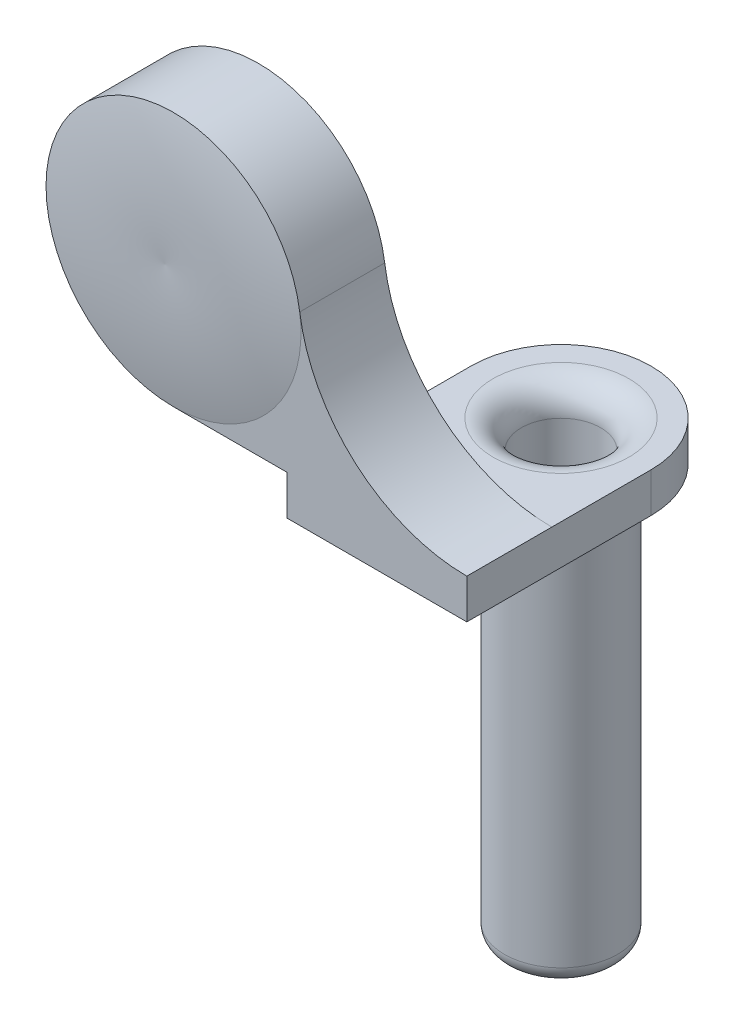
ISO-10303-21;
HEADER;
FILE_DESCRIPTION(('STEP AP214'),'2;1');
FILE_NAME('part.step','',(''),(''),'','','');
FILE_SCHEMA(('AUTOMOTIVE_DESIGN { 1 0 10303 214 1 1 1 1 }'));
ENDSEC;
DATA;
#1=APPLICATION_CONTEXT('core data for automotive mechanical design processes');
#2=APPLICATION_PROTOCOL_DEFINITION('international standard','automotive_design',2000,#1);
#3=PRODUCT_CONTEXT('',#1,'mechanical');
#4=PRODUCT('Part','Part','',(#3));
#5=PRODUCT_RELATED_PRODUCT_CATEGORY('part','',(#4));
#6=PRODUCT_DEFINITION_FORMATION('','',#4);
#7=PRODUCT_DEFINITION_CONTEXT('part definition',#1,'design');
#8=PRODUCT_DEFINITION('design','',#6,#7);
#9=PRODUCT_DEFINITION_SHAPE('','',#8);
#10=(LENGTH_UNIT() NAMED_UNIT(*) SI_UNIT(.MILLI.,.METRE.));
#11=(NAMED_UNIT(*) PLANE_ANGLE_UNIT() SI_UNIT($,.RADIAN.));
#12=(NAMED_UNIT(*) SI_UNIT($,.STERADIAN.) SOLID_ANGLE_UNIT());
#13=UNCERTAINTY_MEASURE_WITH_UNIT(LENGTH_MEASURE(1.E-05),#10,'distance_accuracy_value','');
#14=(GEOMETRIC_REPRESENTATION_CONTEXT(3) GLOBAL_UNCERTAINTY_ASSIGNED_CONTEXT((#13)) GLOBAL_UNIT_ASSIGNED_CONTEXT((#10,
#11,#12)) REPRESENTATION_CONTEXT('',''));
#15=CARTESIAN_POINT('',(0.,0.,0.));
#16=DIRECTION('',(0.,0.,1.));
#17=DIRECTION('',(1.,0.,0.));
#18=AXIS2_PLACEMENT_3D('',#15,#16,#17);
#19=CARTESIAN_POINT('',(3.175,16.,6.5));
#20=DIRECTION('',(0.,1.,0.));
#21=DIRECTION('',(-1.,0.,0.));
#22=AXIS2_PLACEMENT_3D('',#19,#20,#21);
#23=PLANE('',#22);
#24=DIRECTION('',(1.,0.,0.));
#25=VECTOR('',#24,1.);
#26=CARTESIAN_POINT('',(3.175,16.,3.5));
#27=LINE('',#26,#25);
#28=CARTESIAN_POINT('',(-7.18,16.,3.5));
#29=VERTEX_POINT('',#28);
#30=CARTESIAN_POINT('',(-3.175,16.,3.5));
#31=VERTEX_POINT('',#30);
#32=EDGE_CURVE('E186',#29,#31,#27,.T.);
#33=ORIENTED_EDGE('',*,*,#32,.T.);
#34=DIRECTION('',(0.,0.,1.));
#35=VECTOR('',#34,1.);
#36=CARTESIAN_POINT('',(-3.175,16.,-3.176));
#37=LINE('',#36,#35);
#38=CARTESIAN_POINT('',(-3.175,16.,6.5));
#39=VERTEX_POINT('',#38);
#40=EDGE_CURVE('E57',#31,#39,#37,.T.);
#41=ORIENTED_EDGE('',*,*,#40,.T.);
#42=DIRECTION('',(1.,0.,0.));
#43=VECTOR('',#42,1.);
#44=CARTESIAN_POINT('',(3.175,16.,6.5));
#45=LINE('',#44,#43);
#46=CARTESIAN_POINT('',(-7.18,16.,6.5));
#47=VERTEX_POINT('',#46);
#48=EDGE_CURVE('E118',#47,#39,#45,.T.);
#49=ORIENTED_EDGE('',*,*,#48,.F.);
#50=DIRECTION('',(0.,0.,-1.));
#51=VECTOR('',#50,1.);
#52=CARTESIAN_POINT('',(-7.18,16.,6.5));
#53=LINE('',#52,#51);
#54=EDGE_CURVE('E114',#47,#29,#53,.T.);
#55=ORIENTED_EDGE('',*,*,#54,.T.);
#56=EDGE_LOOP('',(#33,#41,#49,#55));
#57=FACE_BOUND('',#56,.T.);
#58=ADVANCED_FACE('F41',(#57),#23,.F.);
#59=CARTESIAN_POINT('',(-7.18,20.5,6.5));
#60=DIRECTION('',(0.,0.,-1.));
#61=DIRECTION('',(-1.,0.,0.));
#62=AXIS2_PLACEMENT_3D('',#59,#60,#61);
#63=CYLINDRICAL_SURFACE('',#62,4.5);
#64=CARTESIAN_POINT('',(-7.18,20.5,3.5));
#65=DIRECTION('',(0.,0.,1.));
#66=DIRECTION('',(1.,0.,0.));
#67=AXIS2_PLACEMENT_3D('',#64,#65,#66);
#68=CIRCLE('',#67,4.5);
#69=CARTESIAN_POINT('',(-2.72389463412405,21.1269967848495,3.5));
#70=VERTEX_POINT('',#69);
#71=EDGE_CURVE('E184',#70,#29,#68,.T.);
#72=ORIENTED_EDGE('',*,*,#71,.T.);
#73=ORIENTED_EDGE('',*,*,#54,.F.);
#74=CARTESIAN_POINT('',(-7.18,20.5,6.5));
#75=DIRECTION('',(0.,0.,1.));
#76=DIRECTION('',(1.,0.,0.));
#77=AXIS2_PLACEMENT_3D('',#74,#75,#76);
#78=CIRCLE('',#77,4.5);
#79=CARTESIAN_POINT('',(-2.72389463412406,21.1269967848495,6.5));
#80=VERTEX_POINT('',#79);
#81=EDGE_CURVE('E108',#80,#47,#78,.T.);
#82=ORIENTED_EDGE('',*,*,#81,.F.);
#83=DIRECTION('',(0.,0.,-1.));
#84=VECTOR('',#83,1.);
#85=CARTESIAN_POINT('',(-2.72389463412405,21.1269967848495,6.84703049766499));
#86=LINE('',#85,#84);
#87=EDGE_CURVE('E111',#80,#70,#86,.T.);
#88=ORIENTED_EDGE('',*,*,#87,.T.);
#89=EDGE_LOOP('',(#72,#73,#82,#88));
#90=FACE_BOUND('',#89,.T.);
#91=ADVANCED_FACE('F110',(#90),#63,.T.);
#92=CARTESIAN_POINT('',(-7.18,20.5,6.5));
#93=DIRECTION('',(0.,0.,1.));
#94=DIRECTION('',(1.,0.,0.));
#95=AXIS2_PLACEMENT_3D('',#92,#93,#94);
#96=PLANE('',#95);
#97=CARTESIAN_POINT('',(3.175,21.9570013888889,6.5));
#98=DIRECTION('',(0.,0.,1.));
#99=DIRECTION('',(1.,0.,0.));
#100=AXIS2_PLACEMENT_3D('',#97,#98,#99);
#101=CIRCLE('',#100,5.95700138888889);
#102=CARTESIAN_POINT('',(3.175,16.,6.5));
#103=VERTEX_POINT('',#102);
#104=EDGE_CURVE('E123',#103,#80,#101,.F.);
#105=ORIENTED_EDGE('',*,*,#104,.T.);
#106=CARTESIAN_POINT('',(-7.18,20.5,6.5));
#107=DIRECTION('',(0.,0.,-1.));
#108=DIRECTION('',(-1.,0.,0.));
#109=AXIS2_PLACEMENT_3D('',#106,#107,#108);
#110=CIRCLE('',#109,4.5);
#111=EDGE_CURVE('E132',#80,#47,#110,.T.);
#112=ORIENTED_EDGE('',*,*,#111,.T.);
#113=ORIENTED_EDGE('',*,*,#48,.T.);
#114=DIRECTION('',(0.,-1.,0.));
#115=VECTOR('',#114,1.);
#116=CARTESIAN_POINT('',(-3.175,16.,6.5));
#117=LINE('',#116,#115);
#118=CARTESIAN_POINT('',(-3.175,14.6,6.5));
#119=VERTEX_POINT('',#118);
#120=EDGE_CURVE('E159',#39,#119,#117,.T.);
#121=ORIENTED_EDGE('',*,*,#120,.T.);
#122=DIRECTION('',(1.,0.,0.));
#123=VECTOR('',#122,1.);
#124=CARTESIAN_POINT('',(-3.175,14.6,6.5));
#125=LINE('',#124,#123);
#126=CARTESIAN_POINT('',(3.175,14.6,6.5));
#127=VERTEX_POINT('',#126);
#128=EDGE_CURVE('E156',#119,#127,#125,.T.);
#129=ORIENTED_EDGE('',*,*,#128,.T.);
#130=DIRECTION('',(0.,1.,0.));
#131=VECTOR('',#130,1.);
#132=CARTESIAN_POINT('',(3.175,14.6,6.5));
#133=LINE('',#132,#131);
#134=EDGE_CURVE('E135',#127,#103,#133,.T.);
#135=ORIENTED_EDGE('',*,*,#134,.T.);
#136=EDGE_LOOP('',(#105,#112,#113,#121,#129,#135));
#137=FACE_BOUND('',#136,.T.);
#138=ADVANCED_FACE('F131',(#137),#96,.T.);
#139=CARTESIAN_POINT('',(-7.18,20.5,3.5));
#140=DIRECTION('',(0.,0.,1.));
#141=DIRECTION('',(1.,0.,0.));
#142=AXIS2_PLACEMENT_3D('',#139,#140,#141);
#143=PLANE('',#142);
#144=CARTESIAN_POINT('',(-7.18,20.5,3.5));
#145=DIRECTION('',(0.,0.,1.));
#146=DIRECTION('',(1.,0.,0.));
#147=AXIS2_PLACEMENT_3D('',#144,#145,#146);
#148=CIRCLE('',#147,3.45);
#149=CARTESIAN_POINT('',(-3.73,20.5,3.5));
#150=VERTEX_POINT('',#149);
#151=EDGE_CURVE('E11',#150,#150,#148,.T.);
#152=ORIENTED_EDGE('',*,*,#151,.T.);
#153=EDGE_LOOP('',(#152));
#154=FACE_BOUND('',#153,.T.);
#155=ORIENTED_EDGE('',*,*,#71,.F.);
#156=CARTESIAN_POINT('',(3.175,21.9570013888889,3.5));
#157=DIRECTION('',(0.,0.,-1.));
#158=DIRECTION('',(-1.,0.,0.));
#159=AXIS2_PLACEMENT_3D('',#156,#157,#158);
#160=CIRCLE('',#159,5.95700138888889);
#161=CARTESIAN_POINT('',(3.175,16.,3.5));
#162=VERTEX_POINT('',#161);
#163=EDGE_CURVE('E125',#162,#70,#160,.T.);
#164=ORIENTED_EDGE('',*,*,#163,.F.);
#165=EDGE_CURVE('E65',#31,#162,#27,.T.);
#166=ORIENTED_EDGE('',*,*,#165,.F.);
#167=ORIENTED_EDGE('',*,*,#32,.F.);
#168=EDGE_LOOP('',(#155,#164,#166,#167));
#169=FACE_BOUND('',#168,.T.);
#170=ADVANCED_FACE('F220',(#154,#169),#143,.F.);
#171=CARTESIAN_POINT('',(-7.18,20.5,6.275));
#172=DIRECTION('',(0.,0.,-1.));
#173=DIRECTION('',(-1.,0.,0.));
#174=AXIS2_PLACEMENT_3D('',#171,#172,#173);
#175=CYLINDRICAL_SURFACE('',#174,3.15);
#176=CARTESIAN_POINT('',(-7.18,20.5,3.8));
#177=DIRECTION('',(0.,0.,1.));
#178=DIRECTION('',(1.,0.,0.));
#179=AXIS2_PLACEMENT_3D('',#176,#177,#178);
#180=CIRCLE('',#179,3.15);
#181=CARTESIAN_POINT('',(-4.03,20.5,3.8));
#182=VERTEX_POINT('',#181);
#183=EDGE_CURVE('E50',#182,#182,#180,.F.);
#184=ORIENTED_EDGE('',*,*,#183,.T.);
#185=EDGE_LOOP('',(#184));
#186=FACE_BOUND('',#185,.T.);
#187=CARTESIAN_POINT('',(-7.18,20.5,6.275));
#188=DIRECTION('',(0.,0.,-1.));
#189=DIRECTION('',(-1.,0.,0.));
#190=AXIS2_PLACEMENT_3D('',#187,#188,#189);
#191=CIRCLE('',#190,3.15);
#192=CARTESIAN_POINT('',(-10.33,20.5,6.275));
#193=VERTEX_POINT('',#192);
#194=EDGE_CURVE('E167',#193,#193,#191,.T.);
#195=ORIENTED_EDGE('',*,*,#194,.F.);
#196=EDGE_LOOP('',(#195));
#197=FACE_BOUND('',#196,.T.);
#198=ADVANCED_FACE('F199',(#186,#197),#175,.F.);
#199=CARTESIAN_POINT('',(-7.18,20.5,6.275));
#200=DIRECTION('',(0.,0.,-1.));
#201=DIRECTION('',(-1.,0.,0.));
#202=AXIS2_PLACEMENT_3D('',#199,#200,#201);
#203=PLANE('',#202);
#204=ORIENTED_EDGE('',*,*,#194,.T.);
#205=EDGE_LOOP('',(#204));
#206=FACE_BOUND('',#205,.T.);
#207=ADVANCED_FACE('F228',(#206),#203,.T.);
#208=CARTESIAN_POINT('',(3.175,16.,-3.176));
#209=DIRECTION('',(0.,1.,0.));
#210=DIRECTION('',(0.,0.,1.));
#211=AXIS2_PLACEMENT_3D('',#208,#209,#210);
#212=PLANE('',#211);
#213=ORIENTED_EDGE('',*,*,#165,.T.);
#214=DIRECTION('',(0.,0.,1.));
#215=VECTOR('',#214,1.);
#216=CARTESIAN_POINT('',(3.175,16.,-3.176));
#217=LINE('',#216,#215);
#218=CARTESIAN_POINT('',(3.175,16.,0.));
#219=VERTEX_POINT('',#218);
#220=EDGE_CURVE('E146',#219,#162,#217,.T.);
#221=ORIENTED_EDGE('',*,*,#220,.F.);
#222=CARTESIAN_POINT('',(0.,16.,0.));
#223=DIRECTION('',(0.,1.,0.));
#224=DIRECTION('',(0.,0.,1.));
#225=AXIS2_PLACEMENT_3D('',#222,#223,#224);
#226=CIRCLE('',#225,3.175);
#227=CARTESIAN_POINT('',(-3.175,16.,0.));
#228=VERTEX_POINT('',#227);
#229=EDGE_CURVE('E272',#219,#228,#226,.T.);
#230=ORIENTED_EDGE('',*,*,#229,.T.);
#231=EDGE_CURVE('E176',#228,#31,#37,.T.);
#232=ORIENTED_EDGE('',*,*,#231,.T.);
#233=EDGE_LOOP('',(#213,#221,#230,#232));
#234=FACE_BOUND('',#233,.T.);
#235=CARTESIAN_POINT('',(0.,16.,0.));
#236=DIRECTION('',(0.,1.,0.));
#237=DIRECTION('',(0.,0.,1.));
#238=AXIS2_PLACEMENT_3D('',#235,#236,#237);
#239=CIRCLE('',#238,2.4);
#240=CARTESIAN_POINT('',(0.,16.,2.4));
#241=VERTEX_POINT('',#240);
#242=EDGE_CURVE('E142',#241,#241,#239,.F.);
#243=ORIENTED_EDGE('',*,*,#242,.T.);
#244=EDGE_LOOP('',(#243));
#245=FACE_BOUND('',#244,.T.);
#246=ADVANCED_FACE('F231',(#234,#245),#212,.T.);
#247=CARTESIAN_POINT('',(3.175,14.6,-3.176));
#248=DIRECTION('',(1.,0.,0.));
#249=DIRECTION('',(0.,0.,-1.));
#250=AXIS2_PLACEMENT_3D('',#247,#248,#249);
#251=PLANE('',#250);
#252=DIRECTION('',(0.,0.,1.));
#253=VECTOR('',#252,1.);
#254=CARTESIAN_POINT('',(3.175,14.6,-3.176));
#255=LINE('',#254,#253);
#256=CARTESIAN_POINT('',(3.175,14.6,0.));
#257=VERTEX_POINT('',#256);
#258=EDGE_CURVE('E171',#257,#127,#255,.T.);
#259=ORIENTED_EDGE('',*,*,#258,.F.);
#260=DIRECTION('',(0.,1.,0.));
#261=VECTOR('',#260,1.);
#262=CARTESIAN_POINT('',(3.175,14.6,0.));
#263=LINE('',#262,#261);
#264=EDGE_CURVE('E141',#257,#219,#263,.T.);
#265=ORIENTED_EDGE('',*,*,#264,.T.);
#266=ORIENTED_EDGE('',*,*,#220,.T.);
#267=DIRECTION('',(0.,0.,-1.));
#268=VECTOR('',#267,1.);
#269=CARTESIAN_POINT('',(3.175,16.,6.5));
#270=LINE('',#269,#268);
#271=EDGE_CURVE('E193',#103,#162,#270,.T.);
#272=ORIENTED_EDGE('',*,*,#271,.F.);
#273=ORIENTED_EDGE('',*,*,#134,.F.);
#274=EDGE_LOOP('',(#259,#265,#266,#272,#273));
#275=FACE_BOUND('',#274,.T.);
#276=ADVANCED_FACE('F237',(#275),#251,.T.);
#277=CARTESIAN_POINT('',(-3.175,14.6,-3.176));
#278=DIRECTION('',(0.,-1.,0.));
#279=DIRECTION('',(0.,0.,-1.));
#280=AXIS2_PLACEMENT_3D('',#277,#278,#279);
#281=PLANE('',#280);
#282=DIRECTION('',(0.,0.,1.));
#283=VECTOR('',#282,1.);
#284=CARTESIAN_POINT('',(-3.175,14.6,-3.176));
#285=LINE('',#284,#283);
#286=CARTESIAN_POINT('',(-3.175,14.6,0.));
#287=VERTEX_POINT('',#286);
#288=EDGE_CURVE('E163',#287,#119,#285,.T.);
#289=ORIENTED_EDGE('',*,*,#288,.F.);
#290=CARTESIAN_POINT('',(0.,14.6,0.));
#291=DIRECTION('',(0.,1.,0.));
#292=DIRECTION('',(0.,0.,1.));
#293=AXIS2_PLACEMENT_3D('',#290,#291,#292);
#294=CIRCLE('',#293,3.175);
#295=EDGE_CURVE('E276',#257,#287,#294,.T.);
#296=ORIENTED_EDGE('',*,*,#295,.F.);
#297=ORIENTED_EDGE('',*,*,#258,.T.);
#298=ORIENTED_EDGE('',*,*,#128,.F.);
#299=EDGE_LOOP('',(#289,#296,#297,#298));
#300=FACE_BOUND('',#299,.T.);
#301=CARTESIAN_POINT('',(0.,14.6,0.));
#302=DIRECTION('',(0.,1.,0.));
#303=DIRECTION('',(0.,0.,1.));
#304=AXIS2_PLACEMENT_3D('',#301,#302,#303);
#305=CIRCLE('',#304,2.);
#306=CARTESIAN_POINT('',(0.,14.6,2.));
#307=VERTEX_POINT('',#306);
#308=EDGE_CURVE('E287',#307,#307,#305,.T.);
#309=ORIENTED_EDGE('',*,*,#308,.T.);
#310=EDGE_LOOP('',(#309));
#311=FACE_BOUND('',#310,.T.);
#312=ADVANCED_FACE('F233',(#300,#311),#281,.T.);
#313=CARTESIAN_POINT('',(-3.175,16.,-3.176));
#314=DIRECTION('',(-1.,0.,0.));
#315=DIRECTION('',(0.,-1.,0.));
#316=AXIS2_PLACEMENT_3D('',#313,#314,#315);
#317=PLANE('',#316);
#318=DIRECTION('',(0.,1.,0.));
#319=VECTOR('',#318,1.);
#320=CARTESIAN_POINT('',(-3.175,14.6,0.));
#321=LINE('',#320,#319);
#322=EDGE_CURVE('E155',#287,#228,#321,.T.);
#323=ORIENTED_EDGE('',*,*,#322,.F.);
#324=ORIENTED_EDGE('',*,*,#288,.T.);
#325=ORIENTED_EDGE('',*,*,#120,.F.);
#326=ORIENTED_EDGE('',*,*,#40,.F.);
#327=ORIENTED_EDGE('',*,*,#231,.F.);
#328=EDGE_LOOP('',(#323,#324,#325,#326,#327));
#329=FACE_BOUND('',#328,.T.);
#330=ADVANCED_FACE('F236',(#329),#317,.T.);
#331=CARTESIAN_POINT('',(-8.38683483178415,20.5,-8.99747752323776));
#332=DIRECTION('',(0.,-1.,0.));
#333=DIRECTION('',(-1.,0.,0.));
#334=AXIS2_PLACEMENT_3D('',#331,#332,#333);
#335=CIRCLE('',#334,15.8435080209028);
#336=TRIMMED_CURVE('',#335,(PARAMETER_VALUE(-1.64704237900645)),
(PARAMETER_VALUE(1.64704237900645)),.T.,.PARAMETER.);
#337=CARTESIAN_POINT('',(-7.18,20.5,-8.99747752323776));
#338=DIRECTION('',(0.,0.,-1.));
#339=AXIS1_PLACEMENT('',#337,#338);
#340=SURFACE_OF_REVOLUTION('',#336,#339);
#341=ORIENTED_EDGE('',*,*,#111,.F.);
#342=ORIENTED_EDGE('',*,*,#81,.T.);
#343=EDGE_LOOP('',(#341,#342));
#344=FACE_BOUND('',#343,.T.);
#345=CARTESIAN_POINT('',(-7.18,20.5,6.8));
#346=VERTEX_POINT('',#345);
#347=VERTEX_LOOP('',#346);
#348=FACE_BOUND('',#347,.T.);
#349=ADVANCED_FACE('F138',(#344,#348),#340,.T.);
#350=CARTESIAN_POINT('',(0.,14.6,0.));
#351=DIRECTION('',(0.,1.,0.));
#352=DIRECTION('',(0.,0.,1.));
#353=AXIS2_PLACEMENT_3D('',#350,#351,#352);
#354=CYLINDRICAL_SURFACE('',#353,3.175);
#355=ORIENTED_EDGE('',*,*,#264,.F.);
#356=ORIENTED_EDGE('',*,*,#295,.T.);
#357=ORIENTED_EDGE('',*,*,#322,.T.);
#358=ORIENTED_EDGE('',*,*,#229,.F.);
#359=EDGE_LOOP('',(#355,#356,#357,#358));
#360=FACE_BOUND('',#359,.T.);
#361=ADVANCED_FACE('F249',(#360),#354,.T.);
#362=CARTESIAN_POINT('',(0.,16.,0.));
#363=DIRECTION('',(0.,-1.,0.));
#364=DIRECTION('',(0.,0.,-1.));
#365=AXIS2_PLACEMENT_3D('',#362,#363,#364);
#366=CYLINDRICAL_SURFACE('',#365,2.);
#367=CARTESIAN_POINT('',(0.,0.6,0.));
#368=DIRECTION('',(0.,1.,0.));
#369=DIRECTION('',(0.,0.,1.));
#370=AXIS2_PLACEMENT_3D('',#367,#368,#369);
#371=CIRCLE('',#370,2.);
#372=CARTESIAN_POINT('',(0.,0.6,2.));
#373=VERTEX_POINT('',#372);
#374=EDGE_CURVE('E282',#373,#373,#371,.T.);
#375=ORIENTED_EDGE('',*,*,#374,.T.);
#376=EDGE_LOOP('',(#375));
#377=FACE_BOUND('',#376,.T.);
#378=ORIENTED_EDGE('',*,*,#308,.F.);
#379=EDGE_LOOP('',(#378));
#380=FACE_BOUND('',#379,.T.);
#381=ADVANCED_FACE('F254',(#377,#380),#366,.T.);
#382=CARTESIAN_POINT('',(0.,0.6,0.));
#383=DIRECTION('',(0.,1.,0.));
#384=DIRECTION('',(0.,0.,1.));
#385=AXIS2_PLACEMENT_3D('',#382,#383,#384);
#386=TOROIDAL_SURFACE('',#385,1.4,0.6);
#387=CARTESIAN_POINT('',(0.,0.,0.));
#388=DIRECTION('',(0.,1.,0.));
#389=DIRECTION('',(0.,0.,1.));
#390=AXIS2_PLACEMENT_3D('',#387,#388,#389);
#391=CIRCLE('',#390,1.4);
#392=CARTESIAN_POINT('',(0.,0.,1.4));
#393=VERTEX_POINT('',#392);
#394=EDGE_CURVE('E127',#393,#393,#391,.F.);
#395=ORIENTED_EDGE('',*,*,#394,.F.);
#396=EDGE_LOOP('',(#395));
#397=FACE_BOUND('',#396,.T.);
#398=ORIENTED_EDGE('',*,*,#374,.F.);
#399=EDGE_LOOP('',(#398));
#400=FACE_BOUND('',#399,.T.);
#401=ADVANCED_FACE('F251',(#397,#400),#386,.T.);
#402=CARTESIAN_POINT('',(0.,25.,0.));
#403=DIRECTION('',(0.,-1.,0.));
#404=DIRECTION('',(0.,0.,-1.));
#405=AXIS2_PLACEMENT_3D('',#402,#403,#404);
#406=CYLINDRICAL_SURFACE('',#405,1.4);
#407=CARTESIAN_POINT('',(0.,15.,0.));
#408=DIRECTION('',(0.,1.,0.));
#409=DIRECTION('',(0.,0.,1.));
#410=AXIS2_PLACEMENT_3D('',#407,#408,#409);
#411=CIRCLE('',#410,1.4);
#412=CARTESIAN_POINT('',(0.,15.,1.4));
#413=VERTEX_POINT('',#412);
#414=EDGE_CURVE('E149',#413,#413,#411,.T.);
#415=ORIENTED_EDGE('',*,*,#414,.T.);
#416=EDGE_LOOP('',(#415));
#417=FACE_BOUND('',#416,.T.);
#418=ORIENTED_EDGE('',*,*,#394,.T.);
#419=EDGE_LOOP('',(#418));
#420=FACE_BOUND('',#419,.T.);
#421=ADVANCED_FACE('F210',(#417,#420),#406,.F.);
#422=CARTESIAN_POINT('',(0.,15.,0.));
#423=DIRECTION('',(0.,1.,0.));
#424=DIRECTION('',(0.,0.,1.));
#425=AXIS2_PLACEMENT_3D('',#422,#423,#424);
#426=TOROIDAL_SURFACE('',#425,2.4,1.);
#427=ORIENTED_EDGE('',*,*,#242,.F.);
#428=EDGE_LOOP('',(#427));
#429=FACE_BOUND('',#428,.T.);
#430=ORIENTED_EDGE('',*,*,#414,.F.);
#431=EDGE_LOOP('',(#430));
#432=FACE_BOUND('',#431,.T.);
#433=ADVANCED_FACE('F203',(#429,#432),#426,.T.);
#434=CARTESIAN_POINT('',(-7.18,20.5,3.8));
#435=DIRECTION('',(0.,0.,1.));
#436=DIRECTION('',(1.,0.,0.));
#437=AXIS2_PLACEMENT_3D('',#434,#435,#436);
#438=TOROIDAL_SURFACE('',#437,3.45,0.3);
#439=ORIENTED_EDGE('',*,*,#151,.F.);
#440=EDGE_LOOP('',(#439));
#441=FACE_BOUND('',#440,.T.);
#442=ORIENTED_EDGE('',*,*,#183,.F.);
#443=EDGE_LOOP('',(#442));
#444=FACE_BOUND('',#443,.T.);
#445=ADVANCED_FACE('F43',(#441,#444),#438,.T.);
#446=CARTESIAN_POINT('',(3.175,21.9570013888889,6.84703049766499));
#447=DIRECTION('',(0.,0.,-1.));
#448=DIRECTION('',(-1.,0.,0.));
#449=AXIS2_PLACEMENT_3D('',#446,#447,#448);
#450=CYLINDRICAL_SURFACE('',#449,5.95700138888889);
#451=ORIENTED_EDGE('',*,*,#271,.T.);
#452=ORIENTED_EDGE('',*,*,#163,.T.);
#453=ORIENTED_EDGE('',*,*,#87,.F.);
#454=ORIENTED_EDGE('',*,*,#104,.F.);
#455=EDGE_LOOP('',(#451,#452,#453,#454));
#456=FACE_BOUND('',#455,.T.);
#457=ADVANCED_FACE('F122',(#456),#450,.F.);
#458=CLOSED_SHELL('',(#58,#91,#138,#170,#198,#207,#246,#276,#312,#330,#349,#361,#381,#401,#421,
#433,#445,#457));
#459=MANIFOLD_SOLID_BREP('B2',#458);
#460=ADVANCED_BREP_SHAPE_REPRESENTATION('',(#18,#459),#14);
#461=SHAPE_DEFINITION_REPRESENTATION(#9,#460);
ENDSEC;
END-ISO-10303-21;
